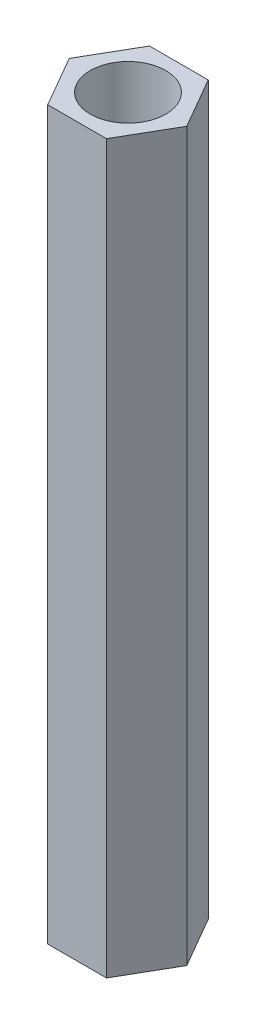
ISO-10303-21;
HEADER;
FILE_DESCRIPTION(('STEP AP214'),'2;1');
FILE_NAME('part.step','',(''),(''),'','','');
FILE_SCHEMA(('AUTOMOTIVE_DESIGN { 1 0 10303 214 1 1 1 1 }'));
ENDSEC;
DATA;
#1=APPLICATION_CONTEXT('core data for automotive mechanical design processes');
#2=APPLICATION_PROTOCOL_DEFINITION('international standard','automotive_design',2000,#1);
#3=PRODUCT_CONTEXT('',#1,'mechanical');
#4=PRODUCT('Part','Part','',(#3));
#5=PRODUCT_RELATED_PRODUCT_CATEGORY('part','',(#4));
#6=PRODUCT_DEFINITION_FORMATION('','',#4);
#7=PRODUCT_DEFINITION_CONTEXT('part definition',#1,'design');
#8=PRODUCT_DEFINITION('design','',#6,#7);
#9=PRODUCT_DEFINITION_SHAPE('','',#8);
#10=(LENGTH_UNIT() NAMED_UNIT(*) SI_UNIT(.MILLI.,.METRE.));
#11=(NAMED_UNIT(*) PLANE_ANGLE_UNIT() SI_UNIT($,.RADIAN.));
#12=(NAMED_UNIT(*) SI_UNIT($,.STERADIAN.) SOLID_ANGLE_UNIT());
#13=UNCERTAINTY_MEASURE_WITH_UNIT(LENGTH_MEASURE(1.E-05),#10,'distance_accuracy_value','');
#14=(GEOMETRIC_REPRESENTATION_CONTEXT(3) GLOBAL_UNCERTAINTY_ASSIGNED_CONTEXT((#13)) GLOBAL_UNIT_ASSIGNED_CONTEXT((#10,
#11,#12)) REPRESENTATION_CONTEXT('',''));
#15=CARTESIAN_POINT('',(0.,0.,0.));
#16=DIRECTION('',(0.,0.,1.));
#17=DIRECTION('',(1.,0.,0.));
#18=AXIS2_PLACEMENT_3D('',#15,#16,#17);
#19=CARTESIAN_POINT('',(0.,0.,0.));
#20=DIRECTION('',(0.,1.,0.));
#21=DIRECTION('',(0.,0.,1.));
#22=AXIS2_PLACEMENT_3D('',#19,#20,#21);
#23=CYLINDRICAL_SURFACE('',#22,2.6);
#24=CARTESIAN_POINT('',(0.,40.,0.));
#25=DIRECTION('',(0.,1.,0.));
#26=DIRECTION('',(0.,0.,1.));
#27=AXIS2_PLACEMENT_3D('',#24,#25,#26);
#28=CIRCLE('',#27,2.6);
#29=CARTESIAN_POINT('',(0.,40.,2.6));
#30=VERTEX_POINT('',#29);
#31=EDGE_CURVE('E187',#30,#30,#28,.F.);
#32=ORIENTED_EDGE('',*,*,#31,.T.);
#33=EDGE_LOOP('',(#32));
#34=FACE_BOUND('',#33,.T.);
#35=CARTESIAN_POINT('',(0.,50.,0.));
#36=DIRECTION('',(0.,1.,0.));
#37=DIRECTION('',(0.,0.,1.));
#38=AXIS2_PLACEMENT_3D('',#35,#36,#37);
#39=CIRCLE('',#38,2.6);
#40=CARTESIAN_POINT('',(0.,50.,2.6));
#41=VERTEX_POINT('',#40);
#42=EDGE_CURVE('E184',#41,#41,#39,.T.);
#43=ORIENTED_EDGE('',*,*,#42,.T.);
#44=EDGE_LOOP('',(#43));
#45=FACE_BOUND('',#44,.T.);
#46=ADVANCED_FACE('F36',(#34,#45),#23,.F.);
#47=CARTESIAN_POINT('',(2.02072594216369,50.,3.5));
#48=DIRECTION('',(-0.866025403784439,0.,-0.5));
#49=DIRECTION('',(-0.5,0.,0.866025403784439));
#50=AXIS2_PLACEMENT_3D('',#47,#48,#49);
#51=PLANE('',#50);
#52=DIRECTION('',(0.5,0.,-0.866025403784439));
#53=VECTOR('',#52,1.);
#54=CARTESIAN_POINT('',(2.02072594216369,0.,3.5));
#55=LINE('',#54,#53);
#56=CARTESIAN_POINT('',(2.02072594216369,0.,3.5));
#57=VERTEX_POINT('',#56);
#58=CARTESIAN_POINT('',(4.04145188432738,0.,0.));
#59=VERTEX_POINT('',#58);
#60=EDGE_CURVE('E121',#57,#59,#55,.T.);
#61=ORIENTED_EDGE('',*,*,#60,.T.);
#62=DIRECTION('',(0.,-1.,0.));
#63=VECTOR('',#62,1.);
#64=CARTESIAN_POINT('',(4.04145188432738,50.,0.));
#65=LINE('',#64,#63);
#66=CARTESIAN_POINT('',(4.04145188432738,50.,0.));
#67=VERTEX_POINT('',#66);
#68=EDGE_CURVE('E12',#67,#59,#65,.T.);
#69=ORIENTED_EDGE('',*,*,#68,.F.);
#70=DIRECTION('',(0.5,0.,-0.866025403784439));
#71=VECTOR('',#70,1.);
#72=CARTESIAN_POINT('',(2.02072594216369,50.,3.5));
#73=LINE('',#72,#71);
#74=CARTESIAN_POINT('',(2.02072594216369,50.,3.5));
#75=VERTEX_POINT('',#74);
#76=EDGE_CURVE('E132',#75,#67,#73,.T.);
#77=ORIENTED_EDGE('',*,*,#76,.F.);
#78=DIRECTION('',(0.,-1.,0.));
#79=VECTOR('',#78,1.);
#80=CARTESIAN_POINT('',(2.02072594216369,50.,3.5));
#81=LINE('',#80,#79);
#82=EDGE_CURVE('E117',#75,#57,#81,.T.);
#83=ORIENTED_EDGE('',*,*,#82,.T.);
#84=EDGE_LOOP('',(#61,#69,#77,#83));
#85=FACE_BOUND('',#84,.T.);
#86=ADVANCED_FACE('F38',(#85),#51,.F.);
#87=CARTESIAN_POINT('',(4.04145188432738,50.,0.));
#88=DIRECTION('',(-0.866025403784439,0.,0.5));
#89=DIRECTION('',(0.5,0.,0.866025403784439));
#90=AXIS2_PLACEMENT_3D('',#87,#88,#89);
#91=PLANE('',#90);
#92=DIRECTION('',(-0.5,0.,-0.866025403784439));
#93=VECTOR('',#92,1.);
#94=CARTESIAN_POINT('',(4.04145188432738,0.,0.));
#95=LINE('',#94,#93);
#96=CARTESIAN_POINT('',(2.02072594216369,0.,-3.5));
#97=VERTEX_POINT('',#96);
#98=EDGE_CURVE('E124',#59,#97,#95,.T.);
#99=ORIENTED_EDGE('',*,*,#98,.T.);
#100=DIRECTION('',(0.,-1.,0.));
#101=VECTOR('',#100,1.);
#102=CARTESIAN_POINT('',(2.02072594216369,50.,-3.5));
#103=LINE('',#102,#101);
#104=CARTESIAN_POINT('',(2.02072594216369,50.,-3.5));
#105=VERTEX_POINT('',#104);
#106=EDGE_CURVE('E45',#105,#97,#103,.T.);
#107=ORIENTED_EDGE('',*,*,#106,.F.);
#108=DIRECTION('',(-0.5,0.,-0.866025403784439));
#109=VECTOR('',#108,1.);
#110=CARTESIAN_POINT('',(4.04145188432738,50.,0.));
#111=LINE('',#110,#109);
#112=EDGE_CURVE('E90',#67,#105,#111,.T.);
#113=ORIENTED_EDGE('',*,*,#112,.F.);
#114=ORIENTED_EDGE('',*,*,#68,.T.);
#115=EDGE_LOOP('',(#99,#107,#113,#114));
#116=FACE_BOUND('',#115,.T.);
#117=ADVANCED_FACE('F163',(#116),#91,.F.);
#118=CARTESIAN_POINT('',(2.02072594216369,50.,-3.5));
#119=DIRECTION('',(0.,0.,1.));
#120=DIRECTION('',(1.,0.,0.));
#121=AXIS2_PLACEMENT_3D('',#118,#119,#120);
#122=PLANE('',#121);
#123=DIRECTION('',(-1.,0.,0.));
#124=VECTOR('',#123,1.);
#125=CARTESIAN_POINT('',(2.02072594216369,0.,-3.5));
#126=LINE('',#125,#124);
#127=CARTESIAN_POINT('',(-2.02072594216369,0.,-3.5));
#128=VERTEX_POINT('',#127);
#129=EDGE_CURVE('E127',#97,#128,#126,.T.);
#130=ORIENTED_EDGE('',*,*,#129,.T.);
#131=DIRECTION('',(0.,-1.,0.));
#132=VECTOR('',#131,1.);
#133=CARTESIAN_POINT('',(-2.02072594216369,50.,-3.5));
#134=LINE('',#133,#132);
#135=CARTESIAN_POINT('',(-2.02072594216369,50.,-3.5));
#136=VERTEX_POINT('',#135);
#137=EDGE_CURVE('E112',#136,#128,#134,.T.);
#138=ORIENTED_EDGE('',*,*,#137,.F.);
#139=DIRECTION('',(-1.,0.,0.));
#140=VECTOR('',#139,1.);
#141=CARTESIAN_POINT('',(2.02072594216369,50.,-3.5));
#142=LINE('',#141,#140);
#143=EDGE_CURVE('E103',#105,#136,#142,.T.);
#144=ORIENTED_EDGE('',*,*,#143,.F.);
#145=ORIENTED_EDGE('',*,*,#106,.T.);
#146=EDGE_LOOP('',(#130,#138,#144,#145));
#147=FACE_BOUND('',#146,.T.);
#148=ADVANCED_FACE('F138',(#147),#122,.F.);
#149=CARTESIAN_POINT('',(-2.02072594216369,50.,-3.5));
#150=DIRECTION('',(0.866025403784438,0.,0.5));
#151=DIRECTION('',(0.5,0.,-0.866025403784438));
#152=AXIS2_PLACEMENT_3D('',#149,#150,#151);
#153=PLANE('',#152);
#154=DIRECTION('',(-0.5,0.,0.866025403784439));
#155=VECTOR('',#154,1.);
#156=CARTESIAN_POINT('',(-2.02072594216369,0.,-3.5));
#157=LINE('',#156,#155);
#158=CARTESIAN_POINT('',(-4.04145188432738,0.,0.));
#159=VERTEX_POINT('',#158);
#160=EDGE_CURVE('E111',#128,#159,#157,.T.);
#161=ORIENTED_EDGE('',*,*,#160,.T.);
#162=DIRECTION('',(0.,-1.,0.));
#163=VECTOR('',#162,1.);
#164=CARTESIAN_POINT('',(-4.04145188432738,50.,0.));
#165=LINE('',#164,#163);
#166=CARTESIAN_POINT('',(-4.04145188432738,50.,0.));
#167=VERTEX_POINT('',#166);
#168=EDGE_CURVE('E108',#167,#159,#165,.T.);
#169=ORIENTED_EDGE('',*,*,#168,.F.);
#170=DIRECTION('',(-0.5,0.,0.866025403784439));
#171=VECTOR('',#170,1.);
#172=CARTESIAN_POINT('',(-2.02072594216369,50.,-3.5));
#173=LINE('',#172,#171);
#174=EDGE_CURVE('E97',#136,#167,#173,.T.);
#175=ORIENTED_EDGE('',*,*,#174,.F.);
#176=ORIENTED_EDGE('',*,*,#137,.T.);
#177=EDGE_LOOP('',(#161,#169,#175,#176));
#178=FACE_BOUND('',#177,.T.);
#179=ADVANCED_FACE('F109',(#178),#153,.F.);
#180=CARTESIAN_POINT('',(-4.04145188432738,50.,0.));
#181=DIRECTION('',(0.866025403784439,0.,-0.5));
#182=DIRECTION('',(-0.5,0.,-0.866025403784439));
#183=AXIS2_PLACEMENT_3D('',#180,#181,#182);
#184=PLANE('',#183);
#185=DIRECTION('',(0.5,0.,0.866025403784439));
#186=VECTOR('',#185,1.);
#187=CARTESIAN_POINT('',(-4.04145188432738,0.,0.));
#188=LINE('',#187,#186);
#189=CARTESIAN_POINT('',(-2.02072594216369,0.,3.5));
#190=VERTEX_POINT('',#189);
#191=EDGE_CURVE('E76',#159,#190,#188,.T.);
#192=ORIENTED_EDGE('',*,*,#191,.T.);
#193=DIRECTION('',(0.,-1.,0.));
#194=VECTOR('',#193,1.);
#195=CARTESIAN_POINT('',(-2.02072594216369,50.,3.5));
#196=LINE('',#195,#194);
#197=CARTESIAN_POINT('',(-2.02072594216369,50.,3.5));
#198=VERTEX_POINT('',#197);
#199=EDGE_CURVE('E113',#198,#190,#196,.T.);
#200=ORIENTED_EDGE('',*,*,#199,.F.);
#201=DIRECTION('',(0.5,0.,0.866025403784439));
#202=VECTOR('',#201,1.);
#203=CARTESIAN_POINT('',(-4.04145188432738,50.,0.));
#204=LINE('',#203,#202);
#205=EDGE_CURVE('E101',#167,#198,#204,.T.);
#206=ORIENTED_EDGE('',*,*,#205,.F.);
#207=ORIENTED_EDGE('',*,*,#168,.T.);
#208=EDGE_LOOP('',(#192,#200,#206,#207));
#209=FACE_BOUND('',#208,.T.);
#210=ADVANCED_FACE('F115',(#209),#184,.F.);
#211=CARTESIAN_POINT('',(-2.02072594216369,50.,3.5));
#212=DIRECTION('',(0.,0.,-1.));
#213=DIRECTION('',(-1.,0.,0.));
#214=AXIS2_PLACEMENT_3D('',#211,#212,#213);
#215=PLANE('',#214);
#216=DIRECTION('',(1.,0.,0.));
#217=VECTOR('',#216,1.);
#218=CARTESIAN_POINT('',(-2.02072594216369,0.,3.5));
#219=LINE('',#218,#217);
#220=EDGE_CURVE('E82',#190,#57,#219,.T.);
#221=ORIENTED_EDGE('',*,*,#220,.T.);
#222=ORIENTED_EDGE('',*,*,#82,.F.);
#223=DIRECTION('',(1.,0.,0.));
#224=VECTOR('',#223,1.);
#225=CARTESIAN_POINT('',(-2.02072594216369,50.,3.5));
#226=LINE('',#225,#224);
#227=EDGE_CURVE('E53',#198,#75,#226,.T.);
#228=ORIENTED_EDGE('',*,*,#227,.F.);
#229=ORIENTED_EDGE('',*,*,#199,.T.);
#230=EDGE_LOOP('',(#221,#222,#228,#229));
#231=FACE_BOUND('',#230,.T.);
#232=ADVANCED_FACE('F145',(#231),#215,.F.);
#233=CARTESIAN_POINT('',(0.,50.,0.));
#234=DIRECTION('',(0.,1.,0.));
#235=DIRECTION('',(0.,0.,1.));
#236=AXIS2_PLACEMENT_3D('',#233,#234,#235);
#237=PLANE('',#236);
#238=ORIENTED_EDGE('',*,*,#42,.F.);
#239=EDGE_LOOP('',(#238));
#240=FACE_BOUND('',#239,.T.);
#241=ORIENTED_EDGE('',*,*,#76,.T.);
#242=ORIENTED_EDGE('',*,*,#112,.T.);
#243=ORIENTED_EDGE('',*,*,#143,.T.);
#244=ORIENTED_EDGE('',*,*,#174,.T.);
#245=ORIENTED_EDGE('',*,*,#205,.T.);
#246=ORIENTED_EDGE('',*,*,#227,.T.);
#247=EDGE_LOOP('',(#241,#242,#243,#244,#245,#246));
#248=FACE_BOUND('',#247,.T.);
#249=ADVANCED_FACE('F99',(#240,#248),#237,.T.);
#250=CARTESIAN_POINT('',(0.,0.,0.));
#251=DIRECTION('',(0.,1.,0.));
#252=DIRECTION('',(0.,0.,1.));
#253=AXIS2_PLACEMENT_3D('',#250,#251,#252);
#254=PLANE('',#253);
#255=CARTESIAN_POINT('',(0.,0.,0.));
#256=DIRECTION('',(0.,1.,0.));
#257=DIRECTION('',(0.,0.,1.));
#258=AXIS2_PLACEMENT_3D('',#255,#256,#257);
#259=CIRCLE('',#258,2.6);
#260=CARTESIAN_POINT('',(0.,0.,2.6));
#261=VERTEX_POINT('',#260);
#262=EDGE_CURVE('E125',#261,#261,#259,.T.);
#263=ORIENTED_EDGE('',*,*,#262,.T.);
#264=EDGE_LOOP('',(#263));
#265=FACE_BOUND('',#264,.T.);
#266=ORIENTED_EDGE('',*,*,#60,.F.);
#267=ORIENTED_EDGE('',*,*,#220,.F.);
#268=ORIENTED_EDGE('',*,*,#191,.F.);
#269=ORIENTED_EDGE('',*,*,#160,.F.);
#270=ORIENTED_EDGE('',*,*,#129,.F.);
#271=ORIENTED_EDGE('',*,*,#98,.F.);
#272=EDGE_LOOP('',(#266,#267,#268,#269,#270,#271));
#273=FACE_BOUND('',#272,.T.);
#274=ADVANCED_FACE('F141',(#265,#273),#254,.F.);
#275=CARTESIAN_POINT('',(0.,10.,0.));
#276=DIRECTION('',(0.,-1.,0.));
#277=DIRECTION('',(0.,0.,-1.));
#278=AXIS2_PLACEMENT_3D('',#275,#276,#277);
#279=CIRCLE('',#278,2.6);
#280=CARTESIAN_POINT('',(0.,10.,-2.6));
#281=VERTEX_POINT('',#280);
#282=EDGE_CURVE('E181',#281,#281,#279,.T.);
#283=ORIENTED_EDGE('',*,*,#282,.F.);
#284=EDGE_LOOP('',(#283));
#285=FACE_BOUND('',#284,.T.);
#286=ORIENTED_EDGE('',*,*,#262,.F.);
#287=EDGE_LOOP('',(#286));
#288=FACE_BOUND('',#287,.T.);
#289=ADVANCED_FACE('F159',(#285,#288),#23,.F.);
#290=CARTESIAN_POINT('',(0.,10.,0.));
#291=DIRECTION('',(0.,-1.,0.));
#292=DIRECTION('',(0.,0.,-1.));
#293=AXIS2_PLACEMENT_3D('',#290,#291,#292);
#294=PLANE('',#293);
#295=ORIENTED_EDGE('',*,*,#282,.T.);
#296=EDGE_LOOP('',(#295));
#297=FACE_BOUND('',#296,.T.);
#298=ADVANCED_FACE('F168',(#297),#294,.T.);
#299=CARTESIAN_POINT('',(0.,40.,0.));
#300=DIRECTION('',(0.,1.,0.));
#301=DIRECTION('',(0.,0.,1.));
#302=AXIS2_PLACEMENT_3D('',#299,#300,#301);
#303=PLANE('',#302);
#304=ORIENTED_EDGE('',*,*,#31,.F.);
#305=EDGE_LOOP('',(#304));
#306=FACE_BOUND('',#305,.T.);
#307=ADVANCED_FACE('F174',(#306),#303,.T.);
#308=CLOSED_SHELL('',(#46,#86,#117,#148,#179,#210,#232,#249,#274,#289,#298,#307));
#309=MANIFOLD_SOLID_BREP('B2',#308);
#310=ADVANCED_BREP_SHAPE_REPRESENTATION('',(#18,#309),#14);
#311=SHAPE_DEFINITION_REPRESENTATION(#9,#310);
ENDSEC;
END-ISO-10303-21;
